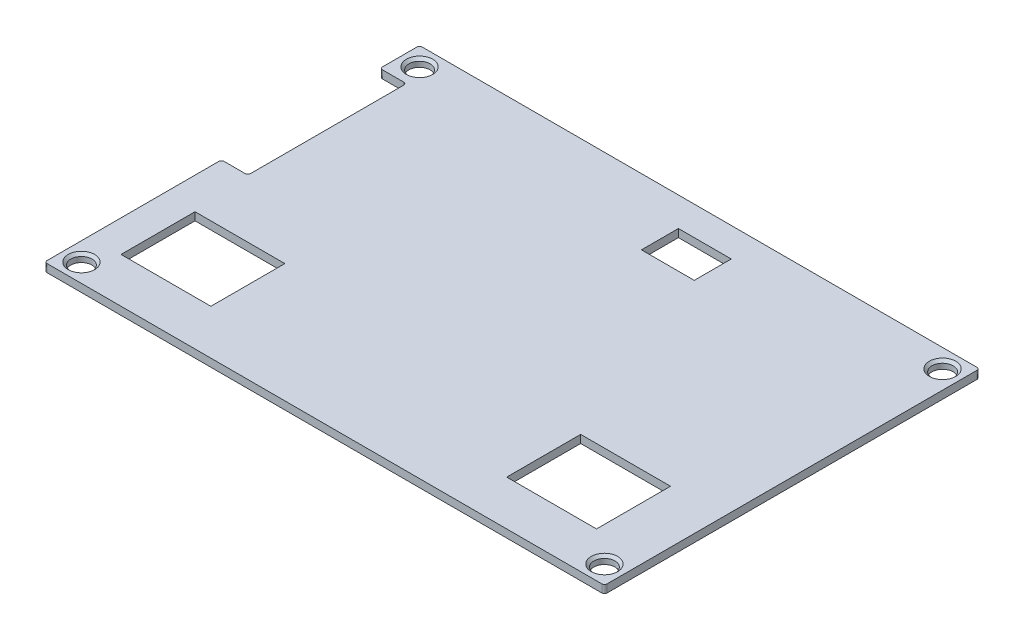
ISO-10303-21;
HEADER;
FILE_DESCRIPTION(('STEP AP214'),'2;1');
FILE_NAME('part.step','',(''),(''),'','','');
FILE_SCHEMA(('AUTOMOTIVE_DESIGN { 1 0 10303 214 1 1 1 1 }'));
ENDSEC;
DATA;
#1=APPLICATION_CONTEXT('core data for automotive mechanical design processes');
#2=APPLICATION_PROTOCOL_DEFINITION('international standard','automotive_design',2000,#1);
#3=PRODUCT_CONTEXT('',#1,'mechanical');
#4=PRODUCT('Part','Part','',(#3));
#5=PRODUCT_RELATED_PRODUCT_CATEGORY('part','',(#4));
#6=PRODUCT_DEFINITION_FORMATION('','',#4);
#7=PRODUCT_DEFINITION_CONTEXT('part definition',#1,'design');
#8=PRODUCT_DEFINITION('design','',#6,#7);
#9=PRODUCT_DEFINITION_SHAPE('','',#8);
#10=(LENGTH_UNIT() NAMED_UNIT(*) SI_UNIT(.MILLI.,.METRE.));
#11=(NAMED_UNIT(*) PLANE_ANGLE_UNIT() SI_UNIT($,.RADIAN.));
#12=(NAMED_UNIT(*) SI_UNIT($,.STERADIAN.) SOLID_ANGLE_UNIT());
#13=UNCERTAINTY_MEASURE_WITH_UNIT(LENGTH_MEASURE(1.E-05),#10,'distance_accuracy_value','');
#14=(GEOMETRIC_REPRESENTATION_CONTEXT(3) GLOBAL_UNCERTAINTY_ASSIGNED_CONTEXT((#13)) GLOBAL_UNIT_ASSIGNED_CONTEXT((#10,
#11,#12)) REPRESENTATION_CONTEXT('',''));
#15=CARTESIAN_POINT('',(0.,0.,0.));
#16=DIRECTION('',(0.,0.,1.));
#17=DIRECTION('',(1.,0.,0.));
#18=AXIS2_PLACEMENT_3D('',#15,#16,#17);
#19=CARTESIAN_POINT('',(-53.,1.5,35.5));
#20=DIRECTION('',(1.,0.,0.));
#21=DIRECTION('',(0.,0.,-1.));
#22=AXIS2_PLACEMENT_3D('',#19,#20,#21);
#23=PLANE('',#22);
#24=DIRECTION('',(0.,0.,1.));
#25=VECTOR('',#24,1.);
#26=CARTESIAN_POINT('',(-53.,1.5,35.5));
#27=LINE('',#26,#25);
#28=CARTESIAN_POINT('',(-53.,1.5,-35.));
#29=VERTEX_POINT('',#28);
#30=CARTESIAN_POINT('',(-53.,1.5,-28.5));
#31=VERTEX_POINT('',#30);
#32=EDGE_CURVE('E383',#29,#31,#27,.T.);
#33=ORIENTED_EDGE('',*,*,#32,.F.);
#34=DIRECTION('',(0.,-1.,0.));
#35=VECTOR('',#34,1.);
#36=CARTESIAN_POINT('',(-53.,1.5,-35.));
#37=LINE('',#36,#35);
#38=CARTESIAN_POINT('',(-53.,0.,-35.));
#39=VERTEX_POINT('',#38);
#40=EDGE_CURVE('E449',#29,#39,#37,.T.);
#41=ORIENTED_EDGE('',*,*,#40,.T.);
#42=DIRECTION('',(0.,0.,1.));
#43=VECTOR('',#42,1.);
#44=CARTESIAN_POINT('',(-53.,0.,35.5));
#45=LINE('',#44,#43);
#46=CARTESIAN_POINT('',(-53.,0.,-28.5));
#47=VERTEX_POINT('',#46);
#48=EDGE_CURVE('E398',#39,#47,#45,.T.);
#49=ORIENTED_EDGE('',*,*,#48,.T.);
#50=DIRECTION('',(0.,1.,0.));
#51=VECTOR('',#50,1.);
#52=CARTESIAN_POINT('',(-53.,1.5,-28.5));
#53=LINE('',#52,#51);
#54=EDGE_CURVE('E445',#47,#31,#53,.T.);
#55=ORIENTED_EDGE('',*,*,#54,.T.);
#56=EDGE_LOOP('',(#33,#41,#49,#55));
#57=FACE_BOUND('',#56,.T.);
#58=ADVANCED_FACE('F41',(#57),#23,.F.);
#59=CARTESIAN_POINT('',(-49.5,0.,32.));
#60=DIRECTION('',(0.,1.,0.));
#61=DIRECTION('',(0.,0.,-1.));
#62=AXIS2_PLACEMENT_3D('',#59,#60,#61);
#63=CYLINDRICAL_SURFACE('',#62,2.);
#64=CARTESIAN_POINT('',(-49.5,1.00000000000001,32.));
#65=DIRECTION('',(0.,-1.,0.));
#66=DIRECTION('',(0.,0.,1.));
#67=AXIS2_PLACEMENT_3D('',#64,#65,#66);
#68=CIRCLE('',#67,2.);
#69=CARTESIAN_POINT('',(-49.5,1.00000000000001,34.));
#70=VERTEX_POINT('',#69);
#71=EDGE_CURVE('E437',#70,#70,#68,.F.);
#72=ORIENTED_EDGE('',*,*,#71,.T.);
#73=EDGE_LOOP('',(#72));
#74=FACE_BOUND('',#73,.T.);
#75=CARTESIAN_POINT('',(-49.5,0.,32.));
#76=DIRECTION('',(0.,1.,0.));
#77=DIRECTION('',(0.,0.,-1.));
#78=AXIS2_PLACEMENT_3D('',#75,#76,#77);
#79=CIRCLE('',#78,2.);
#80=CARTESIAN_POINT('',(-49.5,0.,30.));
#81=VERTEX_POINT('',#80);
#82=EDGE_CURVE('E441',#81,#81,#79,.T.);
#83=ORIENTED_EDGE('',*,*,#82,.F.);
#84=EDGE_LOOP('',(#83));
#85=FACE_BOUND('',#84,.T.);
#86=ADVANCED_FACE('F649',(#74,#85),#63,.F.);
#87=CARTESIAN_POINT('',(-49.5,1.00000000000001,32.));
#88=DIRECTION('',(0.,1.,0.));
#89=DIRECTION('',(0.,0.,-1.));
#90=AXIS2_PLACEMENT_3D('',#87,#88,#89);
#91=CONICAL_SURFACE('',#90,2.,0.785398163397441);
#92=CARTESIAN_POINT('',(-49.5,1.5,32.));
#93=DIRECTION('',(0.,-1.,0.));
#94=DIRECTION('',(0.,0.,1.));
#95=AXIS2_PLACEMENT_3D('',#92,#93,#94);
#96=CIRCLE('',#95,2.49999999999999);
#97=CARTESIAN_POINT('',(-49.5,1.5,34.5));
#98=VERTEX_POINT('',#97);
#99=EDGE_CURVE('E433',#98,#98,#96,.T.);
#100=ORIENTED_EDGE('',*,*,#99,.F.);
#101=EDGE_LOOP('',(#100));
#102=FACE_BOUND('',#101,.T.);
#103=ORIENTED_EDGE('',*,*,#71,.F.);
#104=EDGE_LOOP('',(#103));
#105=FACE_BOUND('',#104,.T.);
#106=ADVANCED_FACE('F654',(#102,#105),#91,.F.);
#107=CARTESIAN_POINT('',(49.5,0.,32.));
#108=DIRECTION('',(0.,1.,0.));
#109=DIRECTION('',(0.,0.,-1.));
#110=AXIS2_PLACEMENT_3D('',#107,#108,#109);
#111=CYLINDRICAL_SURFACE('',#110,2.);
#112=CARTESIAN_POINT('',(49.5,1.00000000000001,32.));
#113=DIRECTION('',(0.,1.,0.));
#114=DIRECTION('',(0.,0.,1.));
#115=AXIS2_PLACEMENT_3D('',#112,#113,#114);
#116=CIRCLE('',#115,2.);
#117=CARTESIAN_POINT('',(49.5,1.00000000000001,34.));
#118=VERTEX_POINT('',#117);
#119=EDGE_CURVE('E425',#118,#118,#116,.F.);
#120=ORIENTED_EDGE('',*,*,#119,.F.);
#121=EDGE_LOOP('',(#120));
#122=FACE_BOUND('',#121,.T.);
#123=CARTESIAN_POINT('',(49.5,0.,32.));
#124=DIRECTION('',(0.,-1.,0.));
#125=DIRECTION('',(0.,0.,-1.));
#126=AXIS2_PLACEMENT_3D('',#123,#124,#125);
#127=CIRCLE('',#126,2.);
#128=CARTESIAN_POINT('',(49.5,0.,30.));
#129=VERTEX_POINT('',#128);
#130=EDGE_CURVE('E429',#129,#129,#127,.T.);
#131=ORIENTED_EDGE('',*,*,#130,.T.);
#132=EDGE_LOOP('',(#131));
#133=FACE_BOUND('',#132,.T.);
#134=ADVANCED_FACE('F690',(#122,#133),#111,.F.);
#135=CARTESIAN_POINT('',(49.5,1.00000000000001,32.));
#136=DIRECTION('',(0.,1.,0.));
#137=DIRECTION('',(0.,0.,-1.));
#138=AXIS2_PLACEMENT_3D('',#135,#136,#137);
#139=CONICAL_SURFACE('',#138,2.,0.785398163397441);
#140=CARTESIAN_POINT('',(49.5,1.5,32.));
#141=DIRECTION('',(0.,1.,0.));
#142=DIRECTION('',(0.,0.,1.));
#143=AXIS2_PLACEMENT_3D('',#140,#141,#142);
#144=CIRCLE('',#143,2.49999999999999);
#145=CARTESIAN_POINT('',(49.5,1.5,34.5));
#146=VERTEX_POINT('',#145);
#147=EDGE_CURVE('E421',#146,#146,#144,.T.);
#148=ORIENTED_EDGE('',*,*,#147,.T.);
#149=EDGE_LOOP('',(#148));
#150=FACE_BOUND('',#149,.T.);
#151=ORIENTED_EDGE('',*,*,#119,.T.);
#152=EDGE_LOOP('',(#151));
#153=FACE_BOUND('',#152,.T.);
#154=ADVANCED_FACE('F686',(#150,#153),#139,.F.);
#155=CARTESIAN_POINT('',(-49.5,0.,-32.));
#156=DIRECTION('',(0.,1.,0.));
#157=DIRECTION('',(0.,0.,1.));
#158=AXIS2_PLACEMENT_3D('',#155,#156,#157);
#159=CYLINDRICAL_SURFACE('',#158,2.);
#160=CARTESIAN_POINT('',(-49.5,1.00000000000001,-32.));
#161=DIRECTION('',(0.,1.,0.));
#162=DIRECTION('',(0.,0.,-1.));
#163=AXIS2_PLACEMENT_3D('',#160,#161,#162);
#164=CIRCLE('',#163,2.);
#165=CARTESIAN_POINT('',(-49.5,1.00000000000001,-34.));
#166=VERTEX_POINT('',#165);
#167=EDGE_CURVE('E413',#166,#166,#164,.F.);
#168=ORIENTED_EDGE('',*,*,#167,.F.);
#169=EDGE_LOOP('',(#168));
#170=FACE_BOUND('',#169,.T.);
#171=CARTESIAN_POINT('',(-49.5,0.,-32.));
#172=DIRECTION('',(0.,-1.,0.));
#173=DIRECTION('',(0.,0.,1.));
#174=AXIS2_PLACEMENT_3D('',#171,#172,#173);
#175=CIRCLE('',#174,2.);
#176=CARTESIAN_POINT('',(-49.5,0.,-30.));
#177=VERTEX_POINT('',#176);
#178=EDGE_CURVE('E417',#177,#177,#175,.T.);
#179=ORIENTED_EDGE('',*,*,#178,.T.);
#180=EDGE_LOOP('',(#179));
#181=FACE_BOUND('',#180,.T.);
#182=ADVANCED_FACE('F682',(#170,#181),#159,.F.);
#183=CARTESIAN_POINT('',(-49.5,1.00000000000001,-32.));
#184=DIRECTION('',(0.,1.,0.));
#185=DIRECTION('',(0.,0.,1.));
#186=AXIS2_PLACEMENT_3D('',#183,#184,#185);
#187=CONICAL_SURFACE('',#186,2.,0.785398163397441);
#188=CARTESIAN_POINT('',(-49.5,1.5,-32.));
#189=DIRECTION('',(0.,1.,0.));
#190=DIRECTION('',(0.,0.,-1.));
#191=AXIS2_PLACEMENT_3D('',#188,#189,#190);
#192=CIRCLE('',#191,2.49999999999999);
#193=CARTESIAN_POINT('',(-49.5,1.5,-34.5));
#194=VERTEX_POINT('',#193);
#195=EDGE_CURVE('E409',#194,#194,#192,.T.);
#196=ORIENTED_EDGE('',*,*,#195,.T.);
#197=EDGE_LOOP('',(#196));
#198=FACE_BOUND('',#197,.T.);
#199=ORIENTED_EDGE('',*,*,#167,.T.);
#200=EDGE_LOOP('',(#199));
#201=FACE_BOUND('',#200,.T.);
#202=ADVANCED_FACE('F679',(#198,#201),#187,.F.);
#203=CARTESIAN_POINT('',(0.,1.5,0.));
#204=DIRECTION('',(0.,-1.,0.));
#205=DIRECTION('',(0.,0.,-1.));
#206=AXIS2_PLACEMENT_3D('',#203,#204,#205);
#207=PLANE('',#206);
#208=ORIENTED_EDGE('',*,*,#99,.T.);
#209=EDGE_LOOP('',(#208));
#210=FACE_BOUND('',#209,.T.);
#211=ORIENTED_EDGE('',*,*,#147,.F.);
#212=EDGE_LOOP('',(#211));
#213=FACE_BOUND('',#212,.T.);
#214=ORIENTED_EDGE('',*,*,#195,.F.);
#215=EDGE_LOOP('',(#214));
#216=FACE_BOUND('',#215,.T.);
#217=CARTESIAN_POINT('',(49.5,1.5,-32.));
#218=DIRECTION('',(0.,-1.,0.));
#219=DIRECTION('',(0.,0.,-1.));
#220=AXIS2_PLACEMENT_3D('',#217,#218,#219);
#221=CIRCLE('',#220,2.49999999999999);
#222=CARTESIAN_POINT('',(49.5,1.5,-34.5));
#223=VERTEX_POINT('',#222);
#224=EDGE_CURVE('E405',#223,#223,#221,.T.);
#225=ORIENTED_EDGE('',*,*,#224,.T.);
#226=EDGE_LOOP('',(#225));
#227=FACE_BOUND('',#226,.T.);
#228=DIRECTION('',(0.,0.,-1.));
#229=VECTOR('',#228,1.);
#230=CARTESIAN_POINT('',(-30.,1.5,27.));
#231=LINE('',#230,#229);
#232=CARTESIAN_POINT('',(-30.,1.5,27.));
#233=VERTEX_POINT('',#232);
#234=CARTESIAN_POINT('',(-30.,1.5,13.));
#235=VERTEX_POINT('',#234);
#236=EDGE_CURVE('E285',#233,#235,#231,.T.);
#237=ORIENTED_EDGE('',*,*,#236,.F.);
#238=DIRECTION('',(1.,0.,0.));
#239=VECTOR('',#238,1.);
#240=CARTESIAN_POINT('',(-47.,1.5,27.));
#241=LINE('',#240,#239);
#242=CARTESIAN_POINT('',(-47.,1.5,27.));
#243=VERTEX_POINT('',#242);
#244=EDGE_CURVE('E296',#243,#233,#241,.T.);
#245=ORIENTED_EDGE('',*,*,#244,.F.);
#246=DIRECTION('',(0.,0.,1.));
#247=VECTOR('',#246,1.);
#248=CARTESIAN_POINT('',(-47.,1.5,27.));
#249=LINE('',#248,#247);
#250=CARTESIAN_POINT('',(-47.,1.5,13.));
#251=VERTEX_POINT('',#250);
#252=EDGE_CURVE('E292',#251,#243,#249,.T.);
#253=ORIENTED_EDGE('',*,*,#252,.F.);
#254=DIRECTION('',(-1.,0.,0.));
#255=VECTOR('',#254,1.);
#256=CARTESIAN_POINT('',(-47.,1.5,13.));
#257=LINE('',#256,#255);
#258=EDGE_CURVE('E288',#235,#251,#257,.T.);
#259=ORIENTED_EDGE('',*,*,#258,.F.);
#260=EDGE_LOOP('',(#237,#245,#253,#259));
#261=FACE_BOUND('',#260,.T.);
#262=DIRECTION('',(-1.,0.,0.));
#263=VECTOR('',#262,1.);
#264=CARTESIAN_POINT('',(-53.,1.5,-35.5));
#265=LINE('',#264,#263);
#266=CARTESIAN_POINT('',(52.5,1.5,-35.5));
#267=VERTEX_POINT('',#266);
#268=CARTESIAN_POINT('',(-52.5,1.5,-35.5));
#269=VERTEX_POINT('',#268);
#270=EDGE_CURVE('E374',#267,#269,#265,.T.);
#271=ORIENTED_EDGE('',*,*,#270,.T.);
#272=CARTESIAN_POINT('',(-52.5,1.5,-35.));
#273=DIRECTION('',(0.,-1.,0.));
#274=DIRECTION('',(0.,0.,-1.));
#275=AXIS2_PLACEMENT_3D('',#272,#273,#274);
#276=CIRCLE('',#275,0.5);
#277=EDGE_CURVE('E492',#269,#29,#276,.F.);
#278=ORIENTED_EDGE('',*,*,#277,.T.);
#279=ORIENTED_EDGE('',*,*,#32,.T.);
#280=CARTESIAN_POINT('',(-52.5,1.5,-28.5));
#281=DIRECTION('',(0.,-1.,0.));
#282=DIRECTION('',(0.,0.,-1.));
#283=AXIS2_PLACEMENT_3D('',#280,#281,#282);
#284=CIRCLE('',#283,0.5);
#285=CARTESIAN_POINT('',(-52.5,1.5,-28.));
#286=VERTEX_POINT('',#285);
#287=EDGE_CURVE('E478',#31,#286,#284,.F.);
#288=ORIENTED_EDGE('',*,*,#287,.T.);
#289=DIRECTION('',(-1.,0.,0.));
#290=VECTOR('',#289,1.);
#291=CARTESIAN_POINT('',(-53.,1.5,-28.));
#292=LINE('',#291,#290);
#293=CARTESIAN_POINT('',(-48.5,1.5,-28.));
#294=VERTEX_POINT('',#293);
#295=EDGE_CURVE('E547',#294,#286,#292,.T.);
#296=ORIENTED_EDGE('',*,*,#295,.F.);
#297=CARTESIAN_POINT('',(-48.5,1.5,-27.5));
#298=DIRECTION('',(0.,-1.,0.));
#299=DIRECTION('',(0.,0.,-1.));
#300=AXIS2_PLACEMENT_3D('',#297,#298,#299);
#301=CIRCLE('',#300,0.5);
#302=CARTESIAN_POINT('',(-48.,1.5,-27.5));
#303=VERTEX_POINT('',#302);
#304=EDGE_CURVE('E50',#294,#303,#301,.T.);
#305=ORIENTED_EDGE('',*,*,#304,.T.);
#306=DIRECTION('',(0.,0.,-1.));
#307=VECTOR('',#306,1.);
#308=CARTESIAN_POINT('',(-48.,1.5,2.));
#309=LINE('',#308,#307);
#310=CARTESIAN_POINT('',(-48.,1.5,1.5));
#311=VERTEX_POINT('',#310);
#312=EDGE_CURVE('E545',#311,#303,#309,.T.);
#313=ORIENTED_EDGE('',*,*,#312,.F.);
#314=CARTESIAN_POINT('',(-48.5,1.5,1.5));
#315=DIRECTION('',(0.,-1.,0.));
#316=DIRECTION('',(0.,0.,-1.));
#317=AXIS2_PLACEMENT_3D('',#314,#315,#316);
#318=CIRCLE('',#317,0.5);
#319=CARTESIAN_POINT('',(-48.5,1.5,2.));
#320=VERTEX_POINT('',#319);
#321=EDGE_CURVE('E535',#311,#320,#318,.T.);
#322=ORIENTED_EDGE('',*,*,#321,.T.);
#323=DIRECTION('',(1.,0.,0.));
#324=VECTOR('',#323,1.);
#325=CARTESIAN_POINT('',(-53.,1.5,2.));
#326=LINE('',#325,#324);
#327=CARTESIAN_POINT('',(-52.5,1.5,2.));
#328=VERTEX_POINT('',#327);
#329=EDGE_CURVE('E557',#328,#320,#326,.T.);
#330=ORIENTED_EDGE('',*,*,#329,.F.);
#331=CARTESIAN_POINT('',(-52.5,1.5,2.5));
#332=DIRECTION('',(0.,-1.,0.));
#333=DIRECTION('',(0.,0.,-1.));
#334=AXIS2_PLACEMENT_3D('',#331,#332,#333);
#335=CIRCLE('',#334,0.5);
#336=CARTESIAN_POINT('',(-53.,1.5,2.5));
#337=VERTEX_POINT('',#336);
#338=EDGE_CURVE('E481',#328,#337,#335,.F.);
#339=ORIENTED_EDGE('',*,*,#338,.T.);
#340=CARTESIAN_POINT('',(-53.,1.5,35.));
#341=VERTEX_POINT('',#340);
#342=EDGE_CURVE('E379',#337,#341,#27,.T.);
#343=ORIENTED_EDGE('',*,*,#342,.T.);
#344=CARTESIAN_POINT('',(-52.5,1.5,35.));
#345=DIRECTION('',(0.,-1.,0.));
#346=DIRECTION('',(0.,0.,-1.));
#347=AXIS2_PLACEMENT_3D('',#344,#345,#346);
#348=CIRCLE('',#347,0.5);
#349=CARTESIAN_POINT('',(-52.5,1.5,35.5));
#350=VERTEX_POINT('',#349);
#351=EDGE_CURVE('E484',#341,#350,#348,.F.);
#352=ORIENTED_EDGE('',*,*,#351,.T.);
#353=DIRECTION('',(1.,0.,0.));
#354=VECTOR('',#353,1.);
#355=CARTESIAN_POINT('',(-53.,1.5,35.5));
#356=LINE('',#355,#354);
#357=CARTESIAN_POINT('',(52.5,1.5,35.5));
#358=VERTEX_POINT('',#357);
#359=EDGE_CURVE('E384',#350,#358,#356,.T.);
#360=ORIENTED_EDGE('',*,*,#359,.T.);
#361=CARTESIAN_POINT('',(52.5,1.5,35.));
#362=DIRECTION('',(0.,-1.,0.));
#363=DIRECTION('',(0.,0.,-1.));
#364=AXIS2_PLACEMENT_3D('',#361,#362,#363);
#365=CIRCLE('',#364,0.5);
#366=CARTESIAN_POINT('',(53.,1.5,35.));
#367=VERTEX_POINT('',#366);
#368=EDGE_CURVE('E64',#358,#367,#365,.F.);
#369=ORIENTED_EDGE('',*,*,#368,.T.);
#370=DIRECTION('',(0.,0.,-1.));
#371=VECTOR('',#370,1.);
#372=CARTESIAN_POINT('',(53.,1.5,35.5));
#373=LINE('',#372,#371);
#374=CARTESIAN_POINT('',(53.,1.5,-35.));
#375=VERTEX_POINT('',#374);
#376=EDGE_CURVE('E371',#367,#375,#373,.T.);
#377=ORIENTED_EDGE('',*,*,#376,.T.);
#378=CARTESIAN_POINT('',(52.5,1.5,-35.));
#379=DIRECTION('',(0.,-1.,0.));
#380=DIRECTION('',(0.,0.,-1.));
#381=AXIS2_PLACEMENT_3D('',#378,#379,#380);
#382=CIRCLE('',#381,0.5);
#383=EDGE_CURVE('E489',#375,#267,#382,.F.);
#384=ORIENTED_EDGE('',*,*,#383,.T.);
#385=EDGE_LOOP('',(#271,#278,#279,#288,#296,#305,#313,#322,#330,#339,#343,#352,#360,#369,#377,#384));
#386=FACE_BOUND('',#385,.T.);
#387=DIRECTION('',(0.,0.,-1.));
#388=VECTOR('',#387,1.);
#389=CARTESIAN_POINT('',(43.,1.5,27.));
#390=LINE('',#389,#388);
#391=CARTESIAN_POINT('',(43.,1.5,27.));
#392=VERTEX_POINT('',#391);
#393=CARTESIAN_POINT('',(43.,1.5,13.));
#394=VERTEX_POINT('',#393);
#395=EDGE_CURVE('E328',#392,#394,#390,.T.);
#396=ORIENTED_EDGE('',*,*,#395,.F.);
#397=DIRECTION('',(1.,0.,0.));
#398=VECTOR('',#397,1.);
#399=CARTESIAN_POINT('',(26.,1.5,27.));
#400=LINE('',#399,#398);
#401=CARTESIAN_POINT('',(26.,1.5,27.));
#402=VERTEX_POINT('',#401);
#403=EDGE_CURVE('E339',#402,#392,#400,.T.);
#404=ORIENTED_EDGE('',*,*,#403,.F.);
#405=DIRECTION('',(0.,0.,1.));
#406=VECTOR('',#405,1.);
#407=CARTESIAN_POINT('',(26.,1.5,27.));
#408=LINE('',#407,#406);
#409=CARTESIAN_POINT('',(26.,1.5,13.));
#410=VERTEX_POINT('',#409);
#411=EDGE_CURVE('E335',#410,#402,#408,.T.);
#412=ORIENTED_EDGE('',*,*,#411,.F.);
#413=DIRECTION('',(-1.,0.,0.));
#414=VECTOR('',#413,1.);
#415=CARTESIAN_POINT('',(26.,1.5,13.));
#416=LINE('',#415,#414);
#417=EDGE_CURVE('E331',#394,#410,#416,.T.);
#418=ORIENTED_EDGE('',*,*,#417,.F.);
#419=EDGE_LOOP('',(#396,#404,#412,#418));
#420=FACE_BOUND('',#419,.T.);
#421=DIRECTION('',(0.,0.,1.));
#422=VECTOR('',#421,1.);
#423=CARTESIAN_POINT('',(1.5,1.5,-30.));
#424=LINE('',#423,#422);
#425=CARTESIAN_POINT('',(1.5,1.5,-30.));
#426=VERTEX_POINT('',#425);
#427=CARTESIAN_POINT('',(1.50000000000001,1.5,-23.));
#428=VERTEX_POINT('',#427);
#429=EDGE_CURVE('E229',#426,#428,#424,.T.);
#430=ORIENTED_EDGE('',*,*,#429,.F.);
#431=DIRECTION('',(-1.,0.,0.));
#432=VECTOR('',#431,1.);
#433=CARTESIAN_POINT('',(1.5,1.5,-30.));
#434=LINE('',#433,#432);
#435=CARTESIAN_POINT('',(11.5,1.5,-30.));
#436=VERTEX_POINT('',#435);
#437=EDGE_CURVE('E259',#436,#426,#434,.T.);
#438=ORIENTED_EDGE('',*,*,#437,.F.);
#439=DIRECTION('',(0.,0.,-1.));
#440=VECTOR('',#439,1.);
#441=CARTESIAN_POINT('',(11.5,1.5,-30.));
#442=LINE('',#441,#440);
#443=CARTESIAN_POINT('',(11.5,1.5,-23.));
#444=VERTEX_POINT('',#443);
#445=EDGE_CURVE('E255',#444,#436,#442,.T.);
#446=ORIENTED_EDGE('',*,*,#445,.F.);
#447=DIRECTION('',(1.,0.,0.));
#448=VECTOR('',#447,1.);
#449=CARTESIAN_POINT('',(1.50000000000001,1.5,-23.));
#450=LINE('',#449,#448);
#451=EDGE_CURVE('E240',#428,#444,#450,.T.);
#452=ORIENTED_EDGE('',*,*,#451,.F.);
#453=EDGE_LOOP('',(#430,#438,#446,#452));
#454=FACE_BOUND('',#453,.T.);
#455=ADVANCED_FACE('F253',(#210,#213,#216,#227,#261,#386,#420,#454),#207,.F.);
#456=CARTESIAN_POINT('',(0.,0.,0.));
#457=DIRECTION('',(0.,-1.,0.));
#458=DIRECTION('',(0.,0.,-1.));
#459=AXIS2_PLACEMENT_3D('',#456,#457,#458);
#460=PLANE('',#459);
#461=ORIENTED_EDGE('',*,*,#48,.F.);
#462=CARTESIAN_POINT('',(-52.5,0.,-35.));
#463=DIRECTION('',(0.,-1.,0.));
#464=DIRECTION('',(0.,0.,-1.));
#465=AXIS2_PLACEMENT_3D('',#462,#463,#464);
#466=CIRCLE('',#465,0.5);
#467=CARTESIAN_POINT('',(-52.5,0.,-35.5));
#468=VERTEX_POINT('',#467);
#469=EDGE_CURVE('E468',#39,#468,#466,.T.);
#470=ORIENTED_EDGE('',*,*,#469,.T.);
#471=DIRECTION('',(-1.,0.,0.));
#472=VECTOR('',#471,1.);
#473=CARTESIAN_POINT('',(-53.,0.,-35.5));
#474=LINE('',#473,#472);
#475=CARTESIAN_POINT('',(52.5,0.,-35.5));
#476=VERTEX_POINT('',#475);
#477=EDGE_CURVE('E390',#476,#468,#474,.T.);
#478=ORIENTED_EDGE('',*,*,#477,.F.);
#479=CARTESIAN_POINT('',(52.5,0.,-35.));
#480=DIRECTION('',(0.,-1.,0.));
#481=DIRECTION('',(0.,0.,-1.));
#482=AXIS2_PLACEMENT_3D('',#479,#480,#481);
#483=CIRCLE('',#482,0.5);
#484=CARTESIAN_POINT('',(53.,0.,-35.));
#485=VERTEX_POINT('',#484);
#486=EDGE_CURVE('E465',#476,#485,#483,.T.);
#487=ORIENTED_EDGE('',*,*,#486,.T.);
#488=DIRECTION('',(0.,0.,-1.));
#489=VECTOR('',#488,1.);
#490=CARTESIAN_POINT('',(53.,0.,35.5));
#491=LINE('',#490,#489);
#492=CARTESIAN_POINT('',(53.,0.,35.));
#493=VERTEX_POINT('',#492);
#494=EDGE_CURVE('E370',#493,#485,#491,.T.);
#495=ORIENTED_EDGE('',*,*,#494,.F.);
#496=CARTESIAN_POINT('',(52.5,0.,35.));
#497=DIRECTION('',(0.,-1.,0.));
#498=DIRECTION('',(0.,0.,-1.));
#499=AXIS2_PLACEMENT_3D('',#496,#497,#498);
#500=CIRCLE('',#499,0.5);
#501=CARTESIAN_POINT('',(52.5,0.,35.5));
#502=VERTEX_POINT('',#501);
#503=EDGE_CURVE('E462',#493,#502,#500,.T.);
#504=ORIENTED_EDGE('',*,*,#503,.T.);
#505=DIRECTION('',(1.,0.,0.));
#506=VECTOR('',#505,1.);
#507=CARTESIAN_POINT('',(-53.,0.,35.5));
#508=LINE('',#507,#506);
#509=CARTESIAN_POINT('',(-52.5,0.,35.5));
#510=VERTEX_POINT('',#509);
#511=EDGE_CURVE('E375',#510,#502,#508,.T.);
#512=ORIENTED_EDGE('',*,*,#511,.F.);
#513=CARTESIAN_POINT('',(-52.5,0.,35.));
#514=DIRECTION('',(0.,-1.,0.));
#515=DIRECTION('',(0.,0.,-1.));
#516=AXIS2_PLACEMENT_3D('',#513,#514,#515);
#517=CIRCLE('',#516,0.5);
#518=CARTESIAN_POINT('',(-53.,0.,35.));
#519=VERTEX_POINT('',#518);
#520=EDGE_CURVE('E459',#510,#519,#517,.T.);
#521=ORIENTED_EDGE('',*,*,#520,.T.);
#522=CARTESIAN_POINT('',(-53.,0.,2.5));
#523=VERTEX_POINT('',#522);
#524=EDGE_CURVE('E394',#523,#519,#45,.T.);
#525=ORIENTED_EDGE('',*,*,#524,.F.);
#526=CARTESIAN_POINT('',(-52.5,0.,2.5));
#527=DIRECTION('',(0.,-1.,0.));
#528=DIRECTION('',(0.,0.,-1.));
#529=AXIS2_PLACEMENT_3D('',#526,#527,#528);
#530=CIRCLE('',#529,0.5);
#531=CARTESIAN_POINT('',(-52.5,0.,2.));
#532=VERTEX_POINT('',#531);
#533=EDGE_CURVE('E456',#523,#532,#530,.T.);
#534=ORIENTED_EDGE('',*,*,#533,.T.);
#535=DIRECTION('',(1.,0.,0.));
#536=VECTOR('',#535,1.);
#537=CARTESIAN_POINT('',(-53.,0.,2.));
#538=LINE('',#537,#536);
#539=CARTESIAN_POINT('',(-48.5,0.,2.));
#540=VERTEX_POINT('',#539);
#541=EDGE_CURVE('E577',#532,#540,#538,.T.);
#542=ORIENTED_EDGE('',*,*,#541,.T.);
#543=CARTESIAN_POINT('',(-48.5,0.,1.5));
#544=DIRECTION('',(0.,-1.,0.));
#545=DIRECTION('',(0.,0.,-1.));
#546=AXIS2_PLACEMENT_3D('',#543,#544,#545);
#547=CIRCLE('',#546,0.5);
#548=CARTESIAN_POINT('',(-48.,0.,1.5));
#549=VERTEX_POINT('',#548);
#550=EDGE_CURVE('E538',#540,#549,#547,.F.);
#551=ORIENTED_EDGE('',*,*,#550,.T.);
#552=DIRECTION('',(0.,0.,-1.));
#553=VECTOR('',#552,1.);
#554=CARTESIAN_POINT('',(-48.,0.,2.));
#555=LINE('',#554,#553);
#556=CARTESIAN_POINT('',(-48.,0.,-27.5));
#557=VERTEX_POINT('',#556);
#558=EDGE_CURVE('E568',#549,#557,#555,.T.);
#559=ORIENTED_EDGE('',*,*,#558,.T.);
#560=CARTESIAN_POINT('',(-48.5,0.,-27.5));
#561=DIRECTION('',(0.,-1.,0.));
#562=DIRECTION('',(0.,0.,-1.));
#563=AXIS2_PLACEMENT_3D('',#560,#561,#562);
#564=CIRCLE('',#563,0.5);
#565=CARTESIAN_POINT('',(-48.5,0.,-28.));
#566=VERTEX_POINT('',#565);
#567=EDGE_CURVE('E11',#557,#566,#564,.F.);
#568=ORIENTED_EDGE('',*,*,#567,.T.);
#569=DIRECTION('',(-1.,0.,0.));
#570=VECTOR('',#569,1.);
#571=CARTESIAN_POINT('',(-53.,0.,-28.));
#572=LINE('',#571,#570);
#573=CARTESIAN_POINT('',(-52.5,0.,-28.));
#574=VERTEX_POINT('',#573);
#575=EDGE_CURVE('E566',#566,#574,#572,.T.);
#576=ORIENTED_EDGE('',*,*,#575,.T.);
#577=CARTESIAN_POINT('',(-52.5,0.,-28.5));
#578=DIRECTION('',(0.,-1.,0.));
#579=DIRECTION('',(0.,0.,-1.));
#580=AXIS2_PLACEMENT_3D('',#577,#578,#579);
#581=CIRCLE('',#580,0.5);
#582=EDGE_CURVE('E453',#574,#47,#581,.T.);
#583=ORIENTED_EDGE('',*,*,#582,.T.);
#584=EDGE_LOOP('',(#461,#470,#478,#487,#495,#504,#512,#521,#525,#534,#542,#551,#559,#568,#576,#583));
#585=FACE_BOUND('',#584,.T.);
#586=ORIENTED_EDGE('',*,*,#82,.T.);
#587=EDGE_LOOP('',(#586));
#588=FACE_BOUND('',#587,.T.);
#589=ORIENTED_EDGE('',*,*,#130,.F.);
#590=EDGE_LOOP('',(#589));
#591=FACE_BOUND('',#590,.T.);
#592=ORIENTED_EDGE('',*,*,#178,.F.);
#593=EDGE_LOOP('',(#592));
#594=FACE_BOUND('',#593,.T.);
#595=CARTESIAN_POINT('',(49.5,0.,-32.));
#596=DIRECTION('',(0.,1.,0.));
#597=DIRECTION('',(0.,0.,1.));
#598=AXIS2_PLACEMENT_3D('',#595,#596,#597);
#599=CIRCLE('',#598,2.);
#600=CARTESIAN_POINT('',(49.5,0.,-30.));
#601=VERTEX_POINT('',#600);
#602=EDGE_CURVE('E268',#601,#601,#599,.T.);
#603=ORIENTED_EDGE('',*,*,#602,.T.);
#604=EDGE_LOOP('',(#603));
#605=FACE_BOUND('',#604,.T.);
#606=DIRECTION('',(1.,0.,0.));
#607=VECTOR('',#606,1.);
#608=CARTESIAN_POINT('',(26.,0.,27.));
#609=LINE('',#608,#607);
#610=CARTESIAN_POINT('',(26.,0.,27.));
#611=VERTEX_POINT('',#610);
#612=CARTESIAN_POINT('',(43.,0.,27.));
#613=VERTEX_POINT('',#612);
#614=EDGE_CURVE('E332',#611,#613,#609,.T.);
#615=ORIENTED_EDGE('',*,*,#614,.T.);
#616=DIRECTION('',(0.,0.,-1.));
#617=VECTOR('',#616,1.);
#618=CARTESIAN_POINT('',(43.,0.,27.));
#619=LINE('',#618,#617);
#620=CARTESIAN_POINT('',(43.,0.,13.));
#621=VERTEX_POINT('',#620);
#622=EDGE_CURVE('E327',#613,#621,#619,.T.);
#623=ORIENTED_EDGE('',*,*,#622,.T.);
#624=DIRECTION('',(-1.,0.,0.));
#625=VECTOR('',#624,1.);
#626=CARTESIAN_POINT('',(26.,0.,13.));
#627=LINE('',#626,#625);
#628=CARTESIAN_POINT('',(26.,0.,13.));
#629=VERTEX_POINT('',#628);
#630=EDGE_CURVE('E346',#621,#629,#627,.T.);
#631=ORIENTED_EDGE('',*,*,#630,.T.);
#632=DIRECTION('',(0.,0.,1.));
#633=VECTOR('',#632,1.);
#634=CARTESIAN_POINT('',(26.,0.,27.));
#635=LINE('',#634,#633);
#636=EDGE_CURVE('E350',#629,#611,#635,.T.);
#637=ORIENTED_EDGE('',*,*,#636,.T.);
#638=EDGE_LOOP('',(#615,#623,#631,#637));
#639=FACE_BOUND('',#638,.T.);
#640=DIRECTION('',(1.,0.,0.));
#641=VECTOR('',#640,1.);
#642=CARTESIAN_POINT('',(-47.,0.,27.));
#643=LINE('',#642,#641);
#644=CARTESIAN_POINT('',(-47.,0.,27.));
#645=VERTEX_POINT('',#644);
#646=CARTESIAN_POINT('',(-30.,0.,27.));
#647=VERTEX_POINT('',#646);
#648=EDGE_CURVE('E289',#645,#647,#643,.T.);
#649=ORIENTED_EDGE('',*,*,#648,.T.);
#650=DIRECTION('',(0.,0.,-1.));
#651=VECTOR('',#650,1.);
#652=CARTESIAN_POINT('',(-30.,0.,27.));
#653=LINE('',#652,#651);
#654=CARTESIAN_POINT('',(-30.,0.,13.));
#655=VERTEX_POINT('',#654);
#656=EDGE_CURVE('E249',#647,#655,#653,.T.);
#657=ORIENTED_EDGE('',*,*,#656,.T.);
#658=DIRECTION('',(-1.,0.,0.));
#659=VECTOR('',#658,1.);
#660=CARTESIAN_POINT('',(-47.,0.,13.));
#661=LINE('',#660,#659);
#662=CARTESIAN_POINT('',(-47.,0.,13.));
#663=VERTEX_POINT('',#662);
#664=EDGE_CURVE('E303',#655,#663,#661,.T.);
#665=ORIENTED_EDGE('',*,*,#664,.T.);
#666=DIRECTION('',(0.,0.,1.));
#667=VECTOR('',#666,1.);
#668=CARTESIAN_POINT('',(-47.,0.,27.));
#669=LINE('',#668,#667);
#670=EDGE_CURVE('E307',#663,#645,#669,.T.);
#671=ORIENTED_EDGE('',*,*,#670,.T.);
#672=EDGE_LOOP('',(#649,#657,#665,#671));
#673=FACE_BOUND('',#672,.T.);
#674=DIRECTION('',(-1.,0.,0.));
#675=VECTOR('',#674,1.);
#676=CARTESIAN_POINT('',(1.5,0.,-30.));
#677=LINE('',#676,#675);
#678=CARTESIAN_POINT('',(11.5,0.,-30.));
#679=VERTEX_POINT('',#678);
#680=CARTESIAN_POINT('',(1.5,0.,-30.));
#681=VERTEX_POINT('',#680);
#682=EDGE_CURVE('E241',#679,#681,#677,.T.);
#683=ORIENTED_EDGE('',*,*,#682,.T.);
#684=DIRECTION('',(0.,0.,1.));
#685=VECTOR('',#684,1.);
#686=CARTESIAN_POINT('',(1.5,0.,-30.));
#687=LINE('',#686,#685);
#688=CARTESIAN_POINT('',(1.50000000000001,0.,-23.));
#689=VERTEX_POINT('',#688);
#690=EDGE_CURVE('E265',#681,#689,#687,.T.);
#691=ORIENTED_EDGE('',*,*,#690,.T.);
#692=DIRECTION('',(1.,0.,0.));
#693=VECTOR('',#692,1.);
#694=CARTESIAN_POINT('',(1.50000000000001,0.,-23.));
#695=LINE('',#694,#693);
#696=CARTESIAN_POINT('',(11.5,0.,-23.));
#697=VERTEX_POINT('',#696);
#698=EDGE_CURVE('E247',#689,#697,#695,.T.);
#699=ORIENTED_EDGE('',*,*,#698,.T.);
#700=DIRECTION('',(0.,0.,-1.));
#701=VECTOR('',#700,1.);
#702=CARTESIAN_POINT('',(11.5,0.,-30.));
#703=LINE('',#702,#701);
#704=EDGE_CURVE('E271',#697,#679,#703,.T.);
#705=ORIENTED_EDGE('',*,*,#704,.T.);
#706=EDGE_LOOP('',(#683,#691,#699,#705));
#707=FACE_BOUND('',#706,.T.);
#708=ADVANCED_FACE('F564',(#585,#588,#591,#594,#605,#639,#673,#707),#460,.T.);
#709=CARTESIAN_POINT('',(53.,1.5,35.5));
#710=DIRECTION('',(-1.,0.,0.));
#711=DIRECTION('',(0.,0.,1.));
#712=AXIS2_PLACEMENT_3D('',#709,#710,#711);
#713=PLANE('',#712);
#714=ORIENTED_EDGE('',*,*,#494,.T.);
#715=DIRECTION('',(0.,-1.,0.));
#716=VECTOR('',#715,1.);
#717=CARTESIAN_POINT('',(53.,1.5,-35.));
#718=LINE('',#717,#716);
#719=EDGE_CURVE('E57',#485,#375,#718,.F.);
#720=ORIENTED_EDGE('',*,*,#719,.T.);
#721=ORIENTED_EDGE('',*,*,#376,.F.);
#722=DIRECTION('',(0.,-1.,0.));
#723=VECTOR('',#722,1.);
#724=CARTESIAN_POINT('',(53.,1.5,35.));
#725=LINE('',#724,#723);
#726=EDGE_CURVE('E495',#367,#493,#725,.T.);
#727=ORIENTED_EDGE('',*,*,#726,.T.);
#728=EDGE_LOOP('',(#714,#720,#721,#727));
#729=FACE_BOUND('',#728,.T.);
#730=ADVANCED_FACE('F618',(#729),#713,.F.);
#731=CARTESIAN_POINT('',(-53.,1.5,-35.5));
#732=DIRECTION('',(0.,0.,1.));
#733=DIRECTION('',(1.,0.,0.));
#734=AXIS2_PLACEMENT_3D('',#731,#732,#733);
#735=PLANE('',#734);
#736=ORIENTED_EDGE('',*,*,#477,.T.);
#737=DIRECTION('',(0.,-1.,0.));
#738=VECTOR('',#737,1.);
#739=CARTESIAN_POINT('',(-52.5,1.5,-35.5));
#740=LINE('',#739,#738);
#741=EDGE_CURVE('E475',#468,#269,#740,.F.);
#742=ORIENTED_EDGE('',*,*,#741,.T.);
#743=ORIENTED_EDGE('',*,*,#270,.F.);
#744=DIRECTION('',(0.,-1.,0.));
#745=VECTOR('',#744,1.);
#746=CARTESIAN_POINT('',(52.5,1.5,-35.5));
#747=LINE('',#746,#745);
#748=EDGE_CURVE('E471',#267,#476,#747,.T.);
#749=ORIENTED_EDGE('',*,*,#748,.T.);
#750=EDGE_LOOP('',(#736,#742,#743,#749));
#751=FACE_BOUND('',#750,.T.);
#752=ADVANCED_FACE('F626',(#751),#735,.F.);
#753=ORIENTED_EDGE('',*,*,#524,.T.);
#754=DIRECTION('',(0.,-1.,0.));
#755=VECTOR('',#754,1.);
#756=CARTESIAN_POINT('',(-53.,1.5,35.));
#757=LINE('',#756,#755);
#758=EDGE_CURVE('E511',#519,#341,#757,.F.);
#759=ORIENTED_EDGE('',*,*,#758,.T.);
#760=ORIENTED_EDGE('',*,*,#342,.F.);
#761=DIRECTION('',(0.,1.,0.));
#762=VECTOR('',#761,1.);
#763=CARTESIAN_POINT('',(-53.,1.5,2.5));
#764=LINE('',#763,#762);
#765=EDGE_CURVE('E508',#337,#523,#764,.F.);
#766=ORIENTED_EDGE('',*,*,#765,.T.);
#767=EDGE_LOOP('',(#753,#759,#760,#766));
#768=FACE_BOUND('',#767,.T.);
#769=ADVANCED_FACE('F604',(#768),#23,.F.);
#770=CARTESIAN_POINT('',(-53.,1.5,35.5));
#771=DIRECTION('',(0.,0.,-1.));
#772=DIRECTION('',(-1.,0.,0.));
#773=AXIS2_PLACEMENT_3D('',#770,#771,#772);
#774=PLANE('',#773);
#775=ORIENTED_EDGE('',*,*,#511,.T.);
#776=DIRECTION('',(0.,-1.,0.));
#777=VECTOR('',#776,1.);
#778=CARTESIAN_POINT('',(52.5,1.5,35.5));
#779=LINE('',#778,#777);
#780=EDGE_CURVE('E505',#502,#358,#779,.F.);
#781=ORIENTED_EDGE('',*,*,#780,.T.);
#782=ORIENTED_EDGE('',*,*,#359,.F.);
#783=DIRECTION('',(0.,-1.,0.));
#784=VECTOR('',#783,1.);
#785=CARTESIAN_POINT('',(-52.5,1.5,35.5));
#786=LINE('',#785,#784);
#787=EDGE_CURVE('E501',#350,#510,#786,.T.);
#788=ORIENTED_EDGE('',*,*,#787,.T.);
#789=EDGE_LOOP('',(#775,#781,#782,#788));
#790=FACE_BOUND('',#789,.T.);
#791=ADVANCED_FACE('F611',(#790),#774,.F.);
#792=CARTESIAN_POINT('',(43.,1.5,27.));
#793=DIRECTION('',(-1.,0.,0.));
#794=DIRECTION('',(0.,0.,1.));
#795=AXIS2_PLACEMENT_3D('',#792,#793,#794);
#796=PLANE('',#795);
#797=ORIENTED_EDGE('',*,*,#622,.F.);
#798=DIRECTION('',(0.,-1.,0.));
#799=VECTOR('',#798,1.);
#800=CARTESIAN_POINT('',(43.,1.5,27.));
#801=LINE('',#800,#799);
#802=EDGE_CURVE('E342',#392,#613,#801,.T.);
#803=ORIENTED_EDGE('',*,*,#802,.F.);
#804=ORIENTED_EDGE('',*,*,#395,.T.);
#805=DIRECTION('',(0.,-1.,0.));
#806=VECTOR('',#805,1.);
#807=CARTESIAN_POINT('',(43.,1.5,13.));
#808=LINE('',#807,#806);
#809=EDGE_CURVE('E366',#394,#621,#808,.T.);
#810=ORIENTED_EDGE('',*,*,#809,.T.);
#811=EDGE_LOOP('',(#797,#803,#804,#810));
#812=FACE_BOUND('',#811,.T.);
#813=ADVANCED_FACE('F664',(#812),#796,.T.);
#814=CARTESIAN_POINT('',(26.,1.5,13.));
#815=DIRECTION('',(0.,0.,1.));
#816=DIRECTION('',(1.,0.,0.));
#817=AXIS2_PLACEMENT_3D('',#814,#815,#816);
#818=PLANE('',#817);
#819=ORIENTED_EDGE('',*,*,#630,.F.);
#820=ORIENTED_EDGE('',*,*,#809,.F.);
#821=ORIENTED_EDGE('',*,*,#417,.T.);
#822=DIRECTION('',(0.,-1.,0.));
#823=VECTOR('',#822,1.);
#824=CARTESIAN_POINT('',(26.,1.5,13.));
#825=LINE('',#824,#823);
#826=EDGE_CURVE('E363',#410,#629,#825,.T.);
#827=ORIENTED_EDGE('',*,*,#826,.T.);
#828=EDGE_LOOP('',(#819,#820,#821,#827));
#829=FACE_BOUND('',#828,.T.);
#830=ADVANCED_FACE('F906',(#829),#818,.T.);
#831=CARTESIAN_POINT('',(26.,1.5,27.));
#832=DIRECTION('',(1.,0.,0.));
#833=DIRECTION('',(0.,0.,-1.));
#834=AXIS2_PLACEMENT_3D('',#831,#832,#833);
#835=PLANE('',#834);
#836=ORIENTED_EDGE('',*,*,#636,.F.);
#837=ORIENTED_EDGE('',*,*,#826,.F.);
#838=ORIENTED_EDGE('',*,*,#411,.T.);
#839=DIRECTION('',(0.,-1.,0.));
#840=VECTOR('',#839,1.);
#841=CARTESIAN_POINT('',(26.,1.5,27.));
#842=LINE('',#841,#840);
#843=EDGE_CURVE('E360',#402,#611,#842,.T.);
#844=ORIENTED_EDGE('',*,*,#843,.T.);
#845=EDGE_LOOP('',(#836,#837,#838,#844));
#846=FACE_BOUND('',#845,.T.);
#847=ADVANCED_FACE('F897',(#846),#835,.T.);
#848=CARTESIAN_POINT('',(26.,1.5,27.));
#849=DIRECTION('',(0.,0.,-1.));
#850=DIRECTION('',(-1.,0.,0.));
#851=AXIS2_PLACEMENT_3D('',#848,#849,#850);
#852=PLANE('',#851);
#853=ORIENTED_EDGE('',*,*,#614,.F.);
#854=ORIENTED_EDGE('',*,*,#843,.F.);
#855=ORIENTED_EDGE('',*,*,#403,.T.);
#856=ORIENTED_EDGE('',*,*,#802,.T.);
#857=EDGE_LOOP('',(#853,#854,#855,#856));
#858=FACE_BOUND('',#857,.T.);
#859=ADVANCED_FACE('F888',(#858),#852,.T.);
#860=CARTESIAN_POINT('',(-30.,1.5,27.));
#861=DIRECTION('',(-1.,0.,0.));
#862=DIRECTION('',(0.,0.,1.));
#863=AXIS2_PLACEMENT_3D('',#860,#861,#862);
#864=PLANE('',#863);
#865=ORIENTED_EDGE('',*,*,#656,.F.);
#866=DIRECTION('',(0.,-1.,0.));
#867=VECTOR('',#866,1.);
#868=CARTESIAN_POINT('',(-30.,1.5,27.));
#869=LINE('',#868,#867);
#870=EDGE_CURVE('E299',#233,#647,#869,.T.);
#871=ORIENTED_EDGE('',*,*,#870,.F.);
#872=ORIENTED_EDGE('',*,*,#236,.T.);
#873=DIRECTION('',(0.,-1.,0.));
#874=VECTOR('',#873,1.);
#875=CARTESIAN_POINT('',(-30.,1.5,13.));
#876=LINE('',#875,#874);
#877=EDGE_CURVE('E323',#235,#655,#876,.T.);
#878=ORIENTED_EDGE('',*,*,#877,.T.);
#879=EDGE_LOOP('',(#865,#871,#872,#878));
#880=FACE_BOUND('',#879,.T.);
#881=ADVANCED_FACE('F879',(#880),#864,.T.);
#882=CARTESIAN_POINT('',(-47.,1.5,13.));
#883=DIRECTION('',(0.,0.,1.));
#884=DIRECTION('',(1.,0.,0.));
#885=AXIS2_PLACEMENT_3D('',#882,#883,#884);
#886=PLANE('',#885);
#887=ORIENTED_EDGE('',*,*,#664,.F.);
#888=ORIENTED_EDGE('',*,*,#877,.F.);
#889=ORIENTED_EDGE('',*,*,#258,.T.);
#890=DIRECTION('',(0.,-1.,0.));
#891=VECTOR('',#890,1.);
#892=CARTESIAN_POINT('',(-47.,1.5,13.));
#893=LINE('',#892,#891);
#894=EDGE_CURVE('E320',#251,#663,#893,.T.);
#895=ORIENTED_EDGE('',*,*,#894,.T.);
#896=EDGE_LOOP('',(#887,#888,#889,#895));
#897=FACE_BOUND('',#896,.T.);
#898=ADVANCED_FACE('F870',(#897),#886,.T.);
#899=CARTESIAN_POINT('',(-47.,1.5,27.));
#900=DIRECTION('',(1.,0.,0.));
#901=DIRECTION('',(0.,0.,-1.));
#902=AXIS2_PLACEMENT_3D('',#899,#900,#901);
#903=PLANE('',#902);
#904=ORIENTED_EDGE('',*,*,#670,.F.);
#905=ORIENTED_EDGE('',*,*,#894,.F.);
#906=ORIENTED_EDGE('',*,*,#252,.T.);
#907=DIRECTION('',(0.,-1.,0.));
#908=VECTOR('',#907,1.);
#909=CARTESIAN_POINT('',(-47.,1.5,27.));
#910=LINE('',#909,#908);
#911=EDGE_CURVE('E317',#243,#645,#910,.T.);
#912=ORIENTED_EDGE('',*,*,#911,.T.);
#913=EDGE_LOOP('',(#904,#905,#906,#912));
#914=FACE_BOUND('',#913,.T.);
#915=ADVANCED_FACE('F861',(#914),#903,.T.);
#916=CARTESIAN_POINT('',(-47.,1.5,27.));
#917=DIRECTION('',(0.,0.,-1.));
#918=DIRECTION('',(-1.,0.,0.));
#919=AXIS2_PLACEMENT_3D('',#916,#917,#918);
#920=PLANE('',#919);
#921=ORIENTED_EDGE('',*,*,#648,.F.);
#922=ORIENTED_EDGE('',*,*,#911,.F.);
#923=ORIENTED_EDGE('',*,*,#244,.T.);
#924=ORIENTED_EDGE('',*,*,#870,.T.);
#925=EDGE_LOOP('',(#921,#922,#923,#924));
#926=FACE_BOUND('',#925,.T.);
#927=ADVANCED_FACE('F853',(#926),#920,.T.);
#928=CARTESIAN_POINT('',(1.5,1.5,-30.));
#929=DIRECTION('',(1.,0.,0.));
#930=DIRECTION('',(0.,0.,-1.));
#931=AXIS2_PLACEMENT_3D('',#928,#929,#930);
#932=PLANE('',#931);
#933=ORIENTED_EDGE('',*,*,#690,.F.);
#934=DIRECTION('',(0.,-1.,0.));
#935=VECTOR('',#934,1.);
#936=CARTESIAN_POINT('',(1.5,1.5,-30.));
#937=LINE('',#936,#935);
#938=EDGE_CURVE('E235',#426,#681,#937,.T.);
#939=ORIENTED_EDGE('',*,*,#938,.F.);
#940=ORIENTED_EDGE('',*,*,#429,.T.);
#941=DIRECTION('',(0.,-1.,0.));
#942=VECTOR('',#941,1.);
#943=CARTESIAN_POINT('',(1.50000000000001,1.5,-23.));
#944=LINE('',#943,#942);
#945=EDGE_CURVE('E232',#428,#689,#944,.T.);
#946=ORIENTED_EDGE('',*,*,#945,.T.);
#947=EDGE_LOOP('',(#933,#939,#940,#946));
#948=FACE_BOUND('',#947,.T.);
#949=ADVANCED_FACE('F231',(#948),#932,.T.);
#950=CARTESIAN_POINT('',(1.50000000000001,1.5,-23.));
#951=DIRECTION('',(0.,0.,-1.));
#952=DIRECTION('',(-1.,0.,0.));
#953=AXIS2_PLACEMENT_3D('',#950,#951,#952);
#954=PLANE('',#953);
#955=ORIENTED_EDGE('',*,*,#698,.F.);
#956=ORIENTED_EDGE('',*,*,#945,.F.);
#957=ORIENTED_EDGE('',*,*,#451,.T.);
#958=DIRECTION('',(0.,-1.,0.));
#959=VECTOR('',#958,1.);
#960=CARTESIAN_POINT('',(11.5,1.5,-23.));
#961=LINE('',#960,#959);
#962=EDGE_CURVE('E250',#444,#697,#961,.T.);
#963=ORIENTED_EDGE('',*,*,#962,.T.);
#964=EDGE_LOOP('',(#955,#956,#957,#963));
#965=FACE_BOUND('',#964,.T.);
#966=ADVANCED_FACE('F244',(#965),#954,.T.);
#967=CARTESIAN_POINT('',(11.5,1.5,-30.));
#968=DIRECTION('',(-1.,0.,0.));
#969=DIRECTION('',(0.,0.,1.));
#970=AXIS2_PLACEMENT_3D('',#967,#968,#969);
#971=PLANE('',#970);
#972=ORIENTED_EDGE('',*,*,#704,.F.);
#973=ORIENTED_EDGE('',*,*,#962,.F.);
#974=ORIENTED_EDGE('',*,*,#445,.T.);
#975=DIRECTION('',(0.,-1.,0.));
#976=VECTOR('',#975,1.);
#977=CARTESIAN_POINT('',(11.5,1.5,-30.));
#978=LINE('',#977,#976);
#979=EDGE_CURVE('E280',#436,#679,#978,.T.);
#980=ORIENTED_EDGE('',*,*,#979,.T.);
#981=EDGE_LOOP('',(#972,#973,#974,#980));
#982=FACE_BOUND('',#981,.T.);
#983=ADVANCED_FACE('F829',(#982),#971,.T.);
#984=CARTESIAN_POINT('',(1.5,1.5,-30.));
#985=DIRECTION('',(0.,0.,1.));
#986=DIRECTION('',(1.,0.,0.));
#987=AXIS2_PLACEMENT_3D('',#984,#985,#986);
#988=PLANE('',#987);
#989=ORIENTED_EDGE('',*,*,#682,.F.);
#990=ORIENTED_EDGE('',*,*,#979,.F.);
#991=ORIENTED_EDGE('',*,*,#437,.T.);
#992=ORIENTED_EDGE('',*,*,#938,.T.);
#993=EDGE_LOOP('',(#989,#990,#991,#992));
#994=FACE_BOUND('',#993,.T.);
#995=ADVANCED_FACE('F820',(#994),#988,.T.);
#996=CARTESIAN_POINT('',(49.5,0.,-32.));
#997=DIRECTION('',(0.,1.,0.));
#998=DIRECTION('',(0.,0.,1.));
#999=AXIS2_PLACEMENT_3D('',#996,#997,#998);
#1000=CYLINDRICAL_SURFACE('',#999,2.);
#1001=CARTESIAN_POINT('',(49.5,1.00000000000001,-32.));
#1002=DIRECTION('',(0.,-1.,0.));
#1003=DIRECTION('',(0.,0.,-1.));
#1004=AXIS2_PLACEMENT_3D('',#1001,#1002,#1003);
#1005=CIRCLE('',#1004,2.);
#1006=CARTESIAN_POINT('',(49.5,1.00000000000001,-34.));
#1007=VERTEX_POINT('',#1006);
#1008=EDGE_CURVE('E387',#1007,#1007,#1005,.F.);
#1009=ORIENTED_EDGE('',*,*,#1008,.T.);
#1010=EDGE_LOOP('',(#1009));
#1011=FACE_BOUND('',#1010,.T.);
#1012=ORIENTED_EDGE('',*,*,#602,.F.);
#1013=EDGE_LOOP('',(#1012));
#1014=FACE_BOUND('',#1013,.T.);
#1015=ADVANCED_FACE('F677',(#1011,#1014),#1000,.F.);
#1016=CARTESIAN_POINT('',(49.5,1.00000000000001,-32.));
#1017=DIRECTION('',(0.,1.,0.));
#1018=DIRECTION('',(0.,0.,1.));
#1019=AXIS2_PLACEMENT_3D('',#1016,#1017,#1018);
#1020=CONICAL_SURFACE('',#1019,2.,0.785398163397441);
#1021=ORIENTED_EDGE('',*,*,#224,.F.);
#1022=EDGE_LOOP('',(#1021));
#1023=FACE_BOUND('',#1022,.T.);
#1024=ORIENTED_EDGE('',*,*,#1008,.F.);
#1025=EDGE_LOOP('',(#1024));
#1026=FACE_BOUND('',#1025,.T.);
#1027=ADVANCED_FACE('F671',(#1023,#1026),#1020,.F.);
#1028=CARTESIAN_POINT('',(-53.,0.,-28.));
#1029=DIRECTION('',(0.,0.,-1.));
#1030=DIRECTION('',(-1.,0.,0.));
#1031=AXIS2_PLACEMENT_3D('',#1028,#1029,#1030);
#1032=PLANE('',#1031);
#1033=ORIENTED_EDGE('',*,*,#295,.T.);
#1034=DIRECTION('',(0.,1.,0.));
#1035=VECTOR('',#1034,1.);
#1036=CARTESIAN_POINT('',(-52.5,0.,-28.));
#1037=LINE('',#1036,#1035);
#1038=EDGE_CURVE('E525',#286,#574,#1037,.F.);
#1039=ORIENTED_EDGE('',*,*,#1038,.T.);
#1040=ORIENTED_EDGE('',*,*,#575,.F.);
#1041=DIRECTION('',(0.,1.,0.));
#1042=VECTOR('',#1041,1.);
#1043=CARTESIAN_POINT('',(-48.5,1.5,-28.));
#1044=LINE('',#1043,#1042);
#1045=EDGE_CURVE('E521',#566,#294,#1044,.T.);
#1046=ORIENTED_EDGE('',*,*,#1045,.T.);
#1047=EDGE_LOOP('',(#1033,#1039,#1040,#1046));
#1048=FACE_BOUND('',#1047,.T.);
#1049=ADVANCED_FACE('F570',(#1048),#1032,.F.);
#1050=CARTESIAN_POINT('',(-48.,0.,2.));
#1051=DIRECTION('',(1.,0.,0.));
#1052=DIRECTION('',(0.,0.,-1.));
#1053=AXIS2_PLACEMENT_3D('',#1050,#1051,#1052);
#1054=PLANE('',#1053);
#1055=ORIENTED_EDGE('',*,*,#558,.F.);
#1056=DIRECTION('',(0.,1.,0.));
#1057=VECTOR('',#1056,1.);
#1058=CARTESIAN_POINT('',(-48.,1.5,1.5));
#1059=LINE('',#1058,#1057);
#1060=EDGE_CURVE('E531',#549,#311,#1059,.T.);
#1061=ORIENTED_EDGE('',*,*,#1060,.T.);
#1062=ORIENTED_EDGE('',*,*,#312,.T.);
#1063=DIRECTION('',(0.,1.,0.));
#1064=VECTOR('',#1063,1.);
#1065=CARTESIAN_POINT('',(-48.,0.,-27.5));
#1066=LINE('',#1065,#1064);
#1067=EDGE_CURVE('E528',#303,#557,#1066,.F.);
#1068=ORIENTED_EDGE('',*,*,#1067,.T.);
#1069=EDGE_LOOP('',(#1055,#1061,#1062,#1068));
#1070=FACE_BOUND('',#1069,.T.);
#1071=ADVANCED_FACE('F553',(#1070),#1054,.F.);
#1072=CARTESIAN_POINT('',(-53.,0.,2.));
#1073=DIRECTION('',(0.,0.,1.));
#1074=DIRECTION('',(1.,0.,0.));
#1075=AXIS2_PLACEMENT_3D('',#1072,#1073,#1074);
#1076=PLANE('',#1075);
#1077=ORIENTED_EDGE('',*,*,#541,.F.);
#1078=DIRECTION('',(0.,1.,0.));
#1079=VECTOR('',#1078,1.);
#1080=CARTESIAN_POINT('',(-52.5,0.,2.));
#1081=LINE('',#1080,#1079);
#1082=EDGE_CURVE('E517',#532,#328,#1081,.T.);
#1083=ORIENTED_EDGE('',*,*,#1082,.T.);
#1084=ORIENTED_EDGE('',*,*,#329,.T.);
#1085=DIRECTION('',(0.,1.,0.));
#1086=VECTOR('',#1085,1.);
#1087=CARTESIAN_POINT('',(-48.5,0.,2.));
#1088=LINE('',#1087,#1086);
#1089=EDGE_CURVE('E514',#320,#540,#1088,.F.);
#1090=ORIENTED_EDGE('',*,*,#1089,.T.);
#1091=EDGE_LOOP('',(#1077,#1083,#1084,#1090));
#1092=FACE_BOUND('',#1091,.T.);
#1093=ADVANCED_FACE('F597',(#1092),#1076,.F.);
#1094=CARTESIAN_POINT('',(-52.5,1.5,-35.));
#1095=DIRECTION('',(0.,-1.,0.));
#1096=DIRECTION('',(0.,0.,-1.));
#1097=AXIS2_PLACEMENT_3D('',#1094,#1095,#1096);
#1098=CYLINDRICAL_SURFACE('',#1097,0.5);
#1099=ORIENTED_EDGE('',*,*,#277,.F.);
#1100=ORIENTED_EDGE('',*,*,#741,.F.);
#1101=ORIENTED_EDGE('',*,*,#469,.F.);
#1102=ORIENTED_EDGE('',*,*,#40,.F.);
#1103=EDGE_LOOP('',(#1099,#1100,#1101,#1102));
#1104=FACE_BOUND('',#1103,.T.);
#1105=ADVANCED_FACE('F633',(#1104),#1098,.T.);
#1106=CARTESIAN_POINT('',(52.5,1.5,-35.));
#1107=DIRECTION('',(0.,-1.,0.));
#1108=DIRECTION('',(0.,0.,-1.));
#1109=AXIS2_PLACEMENT_3D('',#1106,#1107,#1108);
#1110=CYLINDRICAL_SURFACE('',#1109,0.5);
#1111=ORIENTED_EDGE('',*,*,#383,.F.);
#1112=ORIENTED_EDGE('',*,*,#719,.F.);
#1113=ORIENTED_EDGE('',*,*,#486,.F.);
#1114=ORIENTED_EDGE('',*,*,#748,.F.);
#1115=EDGE_LOOP('',(#1111,#1112,#1113,#1114));
#1116=FACE_BOUND('',#1115,.T.);
#1117=ADVANCED_FACE('F623',(#1116),#1110,.T.);
#1118=CARTESIAN_POINT('',(52.5,1.5,35.));
#1119=DIRECTION('',(0.,-1.,0.));
#1120=DIRECTION('',(0.,0.,-1.));
#1121=AXIS2_PLACEMENT_3D('',#1118,#1119,#1120);
#1122=CYLINDRICAL_SURFACE('',#1121,0.5);
#1123=ORIENTED_EDGE('',*,*,#368,.F.);
#1124=ORIENTED_EDGE('',*,*,#780,.F.);
#1125=ORIENTED_EDGE('',*,*,#503,.F.);
#1126=ORIENTED_EDGE('',*,*,#726,.F.);
#1127=EDGE_LOOP('',(#1123,#1124,#1125,#1126));
#1128=FACE_BOUND('',#1127,.T.);
#1129=ADVANCED_FACE('F615',(#1128),#1122,.T.);
#1130=CARTESIAN_POINT('',(-52.5,1.5,35.));
#1131=DIRECTION('',(0.,-1.,0.));
#1132=DIRECTION('',(0.,0.,-1.));
#1133=AXIS2_PLACEMENT_3D('',#1130,#1131,#1132);
#1134=CYLINDRICAL_SURFACE('',#1133,0.5);
#1135=ORIENTED_EDGE('',*,*,#351,.F.);
#1136=ORIENTED_EDGE('',*,*,#758,.F.);
#1137=ORIENTED_EDGE('',*,*,#520,.F.);
#1138=ORIENTED_EDGE('',*,*,#787,.F.);
#1139=EDGE_LOOP('',(#1135,#1136,#1137,#1138));
#1140=FACE_BOUND('',#1139,.T.);
#1141=ADVANCED_FACE('F607',(#1140),#1134,.T.);
#1142=CARTESIAN_POINT('',(-52.5,0.,2.5));
#1143=DIRECTION('',(0.,1.,0.));
#1144=DIRECTION('',(0.,0.,1.));
#1145=AXIS2_PLACEMENT_3D('',#1142,#1143,#1144);
#1146=CYLINDRICAL_SURFACE('',#1145,0.5);
#1147=ORIENTED_EDGE('',*,*,#533,.F.);
#1148=ORIENTED_EDGE('',*,*,#765,.F.);
#1149=ORIENTED_EDGE('',*,*,#338,.F.);
#1150=ORIENTED_EDGE('',*,*,#1082,.F.);
#1151=EDGE_LOOP('',(#1147,#1148,#1149,#1150));
#1152=FACE_BOUND('',#1151,.T.);
#1153=ADVANCED_FACE('F599',(#1152),#1146,.T.);
#1154=CARTESIAN_POINT('',(-52.5,1.5,-28.5));
#1155=DIRECTION('',(0.,1.,0.));
#1156=DIRECTION('',(0.,0.,1.));
#1157=AXIS2_PLACEMENT_3D('',#1154,#1155,#1156);
#1158=CYLINDRICAL_SURFACE('',#1157,0.5);
#1159=ORIENTED_EDGE('',*,*,#582,.F.);
#1160=ORIENTED_EDGE('',*,*,#1038,.F.);
#1161=ORIENTED_EDGE('',*,*,#287,.F.);
#1162=ORIENTED_EDGE('',*,*,#54,.F.);
#1163=EDGE_LOOP('',(#1159,#1160,#1161,#1162));
#1164=FACE_BOUND('',#1163,.T.);
#1165=ADVANCED_FACE('F640',(#1164),#1158,.T.);
#1166=CARTESIAN_POINT('',(-48.5,0.,1.5));
#1167=DIRECTION('',(0.,-1.,0.));
#1168=DIRECTION('',(0.,0.,-1.));
#1169=AXIS2_PLACEMENT_3D('',#1166,#1167,#1168);
#1170=CYLINDRICAL_SURFACE('',#1169,0.5);
#1171=ORIENTED_EDGE('',*,*,#550,.F.);
#1172=ORIENTED_EDGE('',*,*,#1089,.F.);
#1173=ORIENTED_EDGE('',*,*,#321,.F.);
#1174=ORIENTED_EDGE('',*,*,#1060,.F.);
#1175=EDGE_LOOP('',(#1171,#1172,#1173,#1174));
#1176=FACE_BOUND('',#1175,.T.);
#1177=ADVANCED_FACE('F595',(#1176),#1170,.F.);
#1178=CARTESIAN_POINT('',(-48.5,0.,-27.5));
#1179=DIRECTION('',(0.,-1.,0.));
#1180=DIRECTION('',(0.,0.,-1.));
#1181=AXIS2_PLACEMENT_3D('',#1178,#1179,#1180);
#1182=CYLINDRICAL_SURFACE('',#1181,0.5);
#1183=ORIENTED_EDGE('',*,*,#567,.F.);
#1184=ORIENTED_EDGE('',*,*,#1067,.F.);
#1185=ORIENTED_EDGE('',*,*,#304,.F.);
#1186=ORIENTED_EDGE('',*,*,#1045,.F.);
#1187=EDGE_LOOP('',(#1183,#1184,#1185,#1186));
#1188=FACE_BOUND('',#1187,.T.);
#1189=ADVANCED_FACE('F43',(#1188),#1182,.F.);
#1190=CLOSED_SHELL('',(#58,#86,#106,#134,#154,#182,#202,#455,#708,#730,#752,#769,#791,#813,#830,
#847,#859,#881,#898,#915,#927,#949,#966,#983,#995,#1015,#1027,#1049,#1071,#1093,#1105,#1117,
#1129,#1141,#1153,#1165,#1177,#1189));
#1191=MANIFOLD_SOLID_BREP('B2',#1190);
#1192=ADVANCED_BREP_SHAPE_REPRESENTATION('',(#18,#1191),#14);
#1193=SHAPE_DEFINITION_REPRESENTATION(#9,#1192);
ENDSEC;
END-ISO-10303-21;
